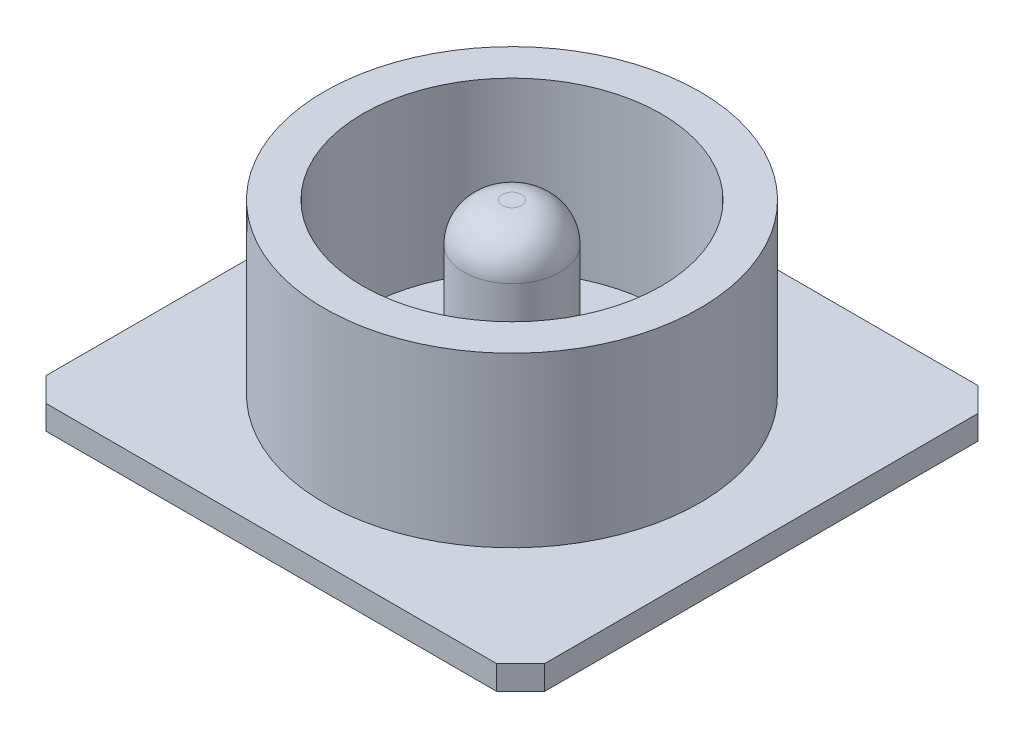
ISO-10303-21;
HEADER;
FILE_DESCRIPTION(('STEP AP214'),'2;1');
FILE_NAME('part.step','',(''),(''),'','','');
FILE_SCHEMA(('AUTOMOTIVE_DESIGN { 1 0 10303 214 1 1 1 1 }'));
ENDSEC;
DATA;
#1=APPLICATION_CONTEXT('core data for automotive mechanical design processes');
#2=APPLICATION_PROTOCOL_DEFINITION('international standard','automotive_design',2000,#1);
#3=PRODUCT_CONTEXT('',#1,'mechanical');
#4=PRODUCT('Part','Part','',(#3));
#5=PRODUCT_RELATED_PRODUCT_CATEGORY('part','',(#4));
#6=PRODUCT_DEFINITION_FORMATION('','',#4);
#7=PRODUCT_DEFINITION_CONTEXT('part definition',#1,'design');
#8=PRODUCT_DEFINITION('design','',#6,#7);
#9=PRODUCT_DEFINITION_SHAPE('','',#8);
#10=(LENGTH_UNIT() NAMED_UNIT(*) SI_UNIT(.MILLI.,.METRE.));
#11=(NAMED_UNIT(*) PLANE_ANGLE_UNIT() SI_UNIT($,.RADIAN.));
#12=(NAMED_UNIT(*) SI_UNIT($,.STERADIAN.) SOLID_ANGLE_UNIT());
#13=UNCERTAINTY_MEASURE_WITH_UNIT(LENGTH_MEASURE(1.E-05),#10,'distance_accuracy_value','');
#14=(GEOMETRIC_REPRESENTATION_CONTEXT(3) GLOBAL_UNCERTAINTY_ASSIGNED_CONTEXT((#13)) GLOBAL_UNIT_ASSIGNED_CONTEXT((#10,
#11,#12)) REPRESENTATION_CONTEXT('',''));
#15=CARTESIAN_POINT('',(0.,0.,0.));
#16=DIRECTION('',(0.,0.,1.));
#17=DIRECTION('',(1.,0.,0.));
#18=AXIS2_PLACEMENT_3D('',#15,#16,#17);
#19=CARTESIAN_POINT('',(-2.98595206377024,0.889,0.));
#20=DIRECTION('',(0.,1.,0.));
#21=DIRECTION('',(0.,0.,1.));
#22=AXIS2_PLACEMENT_3D('',#19,#20,#21);
#23=PLANE('',#22);
#24=CARTESIAN_POINT('',(0.,0.889,0.));
#25=DIRECTION('',(0.,-1.,0.));
#26=DIRECTION('',(0.,0.,-1.));
#27=AXIS2_PLACEMENT_3D('',#24,#25,#26);
#28=CIRCLE('',#27,0.0507999999999999);
#29=CARTESIAN_POINT('',(0.,0.889,-0.0507999999999996));
#30=VERTEX_POINT('',#29);
#31=CARTESIAN_POINT('',(0.,0.889,0.0508000000000001));
#32=VERTEX_POINT('',#31);
#33=EDGE_CURVE('E89',#30,#32,#28,.T.);
#34=ORIENTED_EDGE('',*,*,#33,.F.);
#35=CARTESIAN_POINT('',(0.,0.889,0.));
#36=DIRECTION('',(0.,-1.,0.));
#37=DIRECTION('',(0.,0.,1.));
#38=AXIS2_PLACEMENT_3D('',#35,#36,#37);
#39=CIRCLE('',#38,0.0507999999999999);
#40=EDGE_CURVE('E87',#32,#30,#39,.T.);
#41=ORIENTED_EDGE('',*,*,#40,.F.);
#42=EDGE_LOOP('',(#34,#41));
#43=FACE_BOUND('',#42,.T.);
#44=ADVANCED_FACE('F17',(#43),#23,.T.);
#45=CARTESIAN_POINT('',(0.,0.6858,0.0508000000000001));
#46=DIRECTION('',(1.,0.,0.));
#47=DIRECTION('',(0.,0.,1.));
#48=AXIS2_PLACEMENT_3D('',#45,#46,#47);
#49=CIRCLE('',#48,0.2032);
#50=TRIMMED_CURVE('',#49,(PARAMETER_VALUE(-1.82347658193697)),
(PARAMETER_VALUE(1.82347658193697)),.T.,.PARAMETER.);
#51=CARTESIAN_POINT('',(0.,0.6858,0.));
#52=DIRECTION('',(0.,1.,0.));
#53=AXIS1_PLACEMENT('',#51,#52);
#54=SURFACE_OF_REVOLUTION('',#50,#53);
#55=ORIENTED_EDGE('',*,*,#40,.T.);
#56=ORIENTED_EDGE('',*,*,#33,.T.);
#57=EDGE_LOOP('',(#55,#56));
#58=FACE_BOUND('',#57,.T.);
#59=CARTESIAN_POINT('',(0.,0.6858,0.));
#60=DIRECTION('',(0.,-1.,0.));
#61=DIRECTION('',(0.,0.,-1.));
#62=AXIS2_PLACEMENT_3D('',#59,#60,#61);
#63=CIRCLE('',#62,0.254);
#64=CARTESIAN_POINT('',(0.,0.6858,-0.254));
#65=VERTEX_POINT('',#64);
#66=EDGE_CURVE('E95',#65,#65,#63,.T.);
#67=ORIENTED_EDGE('',*,*,#66,.F.);
#68=EDGE_LOOP('',(#67));
#69=FACE_BOUND('',#68,.T.);
#70=ADVANCED_FACE('F91',(#58,#69),#54,.F.);
#71=CARTESIAN_POINT('',(0.,0.889,0.));
#72=DIRECTION('',(0.,-1.,0.));
#73=DIRECTION('',(0.,0.,-1.));
#74=AXIS2_PLACEMENT_3D('',#71,#72,#73);
#75=CYLINDRICAL_SURFACE('',#74,0.254);
#76=CARTESIAN_POINT('',(0.,0.,0.));
#77=DIRECTION('',(0.,-1.,0.));
#78=DIRECTION('',(0.,0.,-1.));
#79=AXIS2_PLACEMENT_3D('',#76,#77,#78);
#80=CIRCLE('',#79,0.254);
#81=CARTESIAN_POINT('',(0.,0.,-0.254));
#82=VERTEX_POINT('',#81);
#83=EDGE_CURVE('E145',#82,#82,#80,.T.);
#84=ORIENTED_EDGE('',*,*,#83,.F.);
#85=EDGE_LOOP('',(#84));
#86=FACE_BOUND('',#85,.T.);
#87=ORIENTED_EDGE('',*,*,#66,.T.);
#88=EDGE_LOOP('',(#87));
#89=FACE_BOUND('',#88,.T.);
#90=ADVANCED_FACE('F121',(#86,#89),#75,.T.);
#91=CARTESIAN_POINT('',(-2.98595206377024,0.,0.));
#92=DIRECTION('',(0.,1.,0.));
#93=DIRECTION('',(0.,0.,1.));
#94=AXIS2_PLACEMENT_3D('',#91,#92,#93);
#95=PLANE('',#94);
#96=ORIENTED_EDGE('',*,*,#83,.T.);
#97=EDGE_LOOP('',(#96));
#98=FACE_BOUND('',#97,.T.);
#99=CARTESIAN_POINT('',(0.,0.,0.));
#100=DIRECTION('',(0.,-1.,0.));
#101=DIRECTION('',(0.,0.,-1.));
#102=AXIS2_PLACEMENT_3D('',#99,#100,#101);
#103=CIRCLE('',#102,0.7874);
#104=CARTESIAN_POINT('',(0.,0.,-0.7874));
#105=VERTEX_POINT('',#104);
#106=EDGE_CURVE('E142',#105,#105,#103,.F.);
#107=ORIENTED_EDGE('',*,*,#106,.T.);
#108=EDGE_LOOP('',(#107));
#109=FACE_BOUND('',#108,.T.);
#110=ADVANCED_FACE('F153',(#98,#109),#95,.T.);
#111=CARTESIAN_POINT('',(0.,0.889,0.));
#112=DIRECTION('',(0.,-1.,0.));
#113=DIRECTION('',(0.,0.,-1.));
#114=AXIS2_PLACEMENT_3D('',#111,#112,#113);
#115=CYLINDRICAL_SURFACE('',#114,0.7874);
#116=CARTESIAN_POINT('',(0.,0.889,0.));
#117=DIRECTION('',(0.,-1.,0.));
#118=DIRECTION('',(0.,0.,-1.));
#119=AXIS2_PLACEMENT_3D('',#116,#117,#118);
#120=CIRCLE('',#119,0.7874);
#121=CARTESIAN_POINT('',(0.,0.889,-0.7874));
#122=VERTEX_POINT('',#121);
#123=EDGE_CURVE('E139',#122,#122,#120,.T.);
#124=ORIENTED_EDGE('',*,*,#123,.F.);
#125=EDGE_LOOP('',(#124));
#126=FACE_BOUND('',#125,.T.);
#127=ORIENTED_EDGE('',*,*,#106,.F.);
#128=EDGE_LOOP('',(#127));
#129=FACE_BOUND('',#128,.T.);
#130=ADVANCED_FACE('F159',(#126,#129),#115,.F.);
#131=CARTESIAN_POINT('',(-2.98595206377024,0.889,0.));
#132=DIRECTION('',(0.,1.,0.));
#133=DIRECTION('',(0.,0.,1.));
#134=AXIS2_PLACEMENT_3D('',#131,#132,#133);
#135=PLANE('',#134);
#136=CARTESIAN_POINT('',(0.,0.889,0.));
#137=DIRECTION('',(0.,-1.,0.));
#138=DIRECTION('',(0.,0.,-1.));
#139=AXIS2_PLACEMENT_3D('',#136,#137,#138);
#140=CIRCLE('',#139,0.990599999999999);
#141=CARTESIAN_POINT('',(0.,0.889,-0.990599999999999));
#142=VERTEX_POINT('',#141);
#143=EDGE_CURVE('E136',#142,#142,#140,.T.);
#144=ORIENTED_EDGE('',*,*,#143,.F.);
#145=EDGE_LOOP('',(#144));
#146=FACE_BOUND('',#145,.T.);
#147=ORIENTED_EDGE('',*,*,#123,.T.);
#148=EDGE_LOOP('',(#147));
#149=FACE_BOUND('',#148,.T.);
#150=ADVANCED_FACE('F207',(#146,#149),#135,.T.);
#151=CARTESIAN_POINT('',(0.,0.889,0.));
#152=DIRECTION('',(0.,-1.,0.));
#153=DIRECTION('',(0.,0.,-1.));
#154=AXIS2_PLACEMENT_3D('',#151,#152,#153);
#155=CYLINDRICAL_SURFACE('',#154,0.990599999999999);
#156=CARTESIAN_POINT('',(0.,0.,0.));
#157=DIRECTION('',(0.,-1.,0.));
#158=DIRECTION('',(0.,0.,-1.));
#159=AXIS2_PLACEMENT_3D('',#156,#157,#158);
#160=CIRCLE('',#159,0.990599999999999);
#161=CARTESIAN_POINT('',(0.,0.,-0.990599999999999));
#162=VERTEX_POINT('',#161);
#163=EDGE_CURVE('E127',#162,#162,#160,.T.);
#164=ORIENTED_EDGE('',*,*,#163,.F.);
#165=EDGE_LOOP('',(#164));
#166=FACE_BOUND('',#165,.T.);
#167=ORIENTED_EDGE('',*,*,#143,.T.);
#168=EDGE_LOOP('',(#167));
#169=FACE_BOUND('',#168,.T.);
#170=ADVANCED_FACE('F203',(#166,#169),#155,.T.);
#171=CARTESIAN_POINT('',(-2.98595206377024,0.,0.));
#172=DIRECTION('',(0.,1.,0.));
#173=DIRECTION('',(0.,0.,1.));
#174=AXIS2_PLACEMENT_3D('',#171,#172,#173);
#175=PLANE('',#174);
#176=ORIENTED_EDGE('',*,*,#163,.T.);
#177=EDGE_LOOP('',(#176));
#178=FACE_BOUND('',#177,.T.);
#179=DIRECTION('',(0.,0.,-1.));
#180=VECTOR('',#179,1.);
#181=CARTESIAN_POINT('',(1.31553605108081,0.,0.));
#182=LINE('',#181,#180);
#183=CARTESIAN_POINT('',(1.31553605108081,0.,-1.143));
#184=VERTEX_POINT('',#183);
#185=CARTESIAN_POINT('',(1.31553605108081,0.,1.143));
#186=VERTEX_POINT('',#185);
#187=EDGE_CURVE('E332',#184,#186,#182,.F.);
#188=ORIENTED_EDGE('',*,*,#187,.F.);
#189=DIRECTION('',(-0.707106781186548,0.,-0.707106781186548));
#190=VECTOR('',#189,1.);
#191=CARTESIAN_POINT('',(1.31553605108081,0.,-1.143));
#192=LINE('',#191,#190);
#193=CARTESIAN_POINT('',(1.18853605108081,0.,-1.27));
#194=VERTEX_POINT('',#193);
#195=EDGE_CURVE('E334',#194,#184,#192,.F.);
#196=ORIENTED_EDGE('',*,*,#195,.F.);
#197=DIRECTION('',(1.,0.,0.));
#198=VECTOR('',#197,1.);
#199=CARTESIAN_POINT('',(-2.98595206377024,0.,-1.27));
#200=LINE('',#199,#198);
#201=CARTESIAN_POINT('',(-1.18853605108081,0.,-1.27));
#202=VERTEX_POINT('',#201);
#203=EDGE_CURVE('E350',#194,#202,#200,.F.);
#204=ORIENTED_EDGE('',*,*,#203,.T.);
#205=DIRECTION('',(0.707106781186545,0.,-0.70710678118655));
#206=VECTOR('',#205,1.);
#207=CARTESIAN_POINT('',(-1.18853605108081,0.,-1.27));
#208=LINE('',#207,#206);
#209=CARTESIAN_POINT('',(-1.31553605108081,0.,-1.143));
#210=VERTEX_POINT('',#209);
#211=EDGE_CURVE('E371',#202,#210,#208,.F.);
#212=ORIENTED_EDGE('',*,*,#211,.T.);
#213=DIRECTION('',(0.,0.,-1.));
#214=VECTOR('',#213,1.);
#215=CARTESIAN_POINT('',(-1.31553605108081,0.,0.));
#216=LINE('',#215,#214);
#217=CARTESIAN_POINT('',(-1.31553605108081,0.,1.143));
#218=VERTEX_POINT('',#217);
#219=EDGE_CURVE('E370',#210,#218,#216,.F.);
#220=ORIENTED_EDGE('',*,*,#219,.T.);
#221=DIRECTION('',(0.707106781186549,0.,0.707106781186546));
#222=VECTOR('',#221,1.);
#223=CARTESIAN_POINT('',(-1.31553605108081,0.,1.143));
#224=LINE('',#223,#222);
#225=CARTESIAN_POINT('',(-1.18853605108081,0.,1.27));
#226=VERTEX_POINT('',#225);
#227=EDGE_CURVE('E135',#226,#218,#224,.F.);
#228=ORIENTED_EDGE('',*,*,#227,.F.);
#229=DIRECTION('',(1.,0.,0.));
#230=VECTOR('',#229,1.);
#231=CARTESIAN_POINT('',(-2.98595206377024,0.,1.27));
#232=LINE('',#231,#230);
#233=CARTESIAN_POINT('',(1.18853605108081,0.,1.27));
#234=VERTEX_POINT('',#233);
#235=EDGE_CURVE('E362',#234,#226,#232,.F.);
#236=ORIENTED_EDGE('',*,*,#235,.F.);
#237=DIRECTION('',(-0.707106781186545,0.,0.70710678118655));
#238=VECTOR('',#237,1.);
#239=CARTESIAN_POINT('',(1.18853605108081,0.,1.27));
#240=LINE('',#239,#238);
#241=EDGE_CURVE('E337',#234,#186,#240,.F.);
#242=ORIENTED_EDGE('',*,*,#241,.T.);
#243=EDGE_LOOP('',(#188,#196,#204,#212,#220,#228,#236,#242));
#244=FACE_BOUND('',#243,.T.);
#245=ADVANCED_FACE('F199',(#178,#244),#175,.T.);
#246=CARTESIAN_POINT('',(-1.31553605108081,-0.127,1.143));
#247=DIRECTION('',(-0.707106781186546,0.,0.707106781186549));
#248=DIRECTION('',(0.707106781186549,0.,0.707106781186546));
#249=AXIS2_PLACEMENT_3D('',#246,#247,#248);
#250=PLANE('',#249);
#251=ORIENTED_EDGE('',*,*,#227,.T.);
#252=DIRECTION('',(0.,1.,0.));
#253=VECTOR('',#252,1.);
#254=CARTESIAN_POINT('',(-1.31553605108081,-0.127,1.143));
#255=LINE('',#254,#253);
#256=CARTESIAN_POINT('',(-1.31553605108081,-0.127,1.143));
#257=VERTEX_POINT('',#256);
#258=EDGE_CURVE('E368',#218,#257,#255,.F.);
#259=ORIENTED_EDGE('',*,*,#258,.T.);
#260=DIRECTION('',(0.707106781186547,0.,0.707106781186547));
#261=VECTOR('',#260,1.);
#262=CARTESIAN_POINT('',(-1.31553605108081,-0.127,1.143));
#263=LINE('',#262,#261);
#264=CARTESIAN_POINT('',(-1.18853605108081,-0.127,1.27));
#265=VERTEX_POINT('',#264);
#266=EDGE_CURVE('E374',#257,#265,#263,.T.);
#267=ORIENTED_EDGE('',*,*,#266,.T.);
#268=DIRECTION('',(0.,1.,0.));
#269=VECTOR('',#268,1.);
#270=CARTESIAN_POINT('',(-1.18853605108081,-0.127,1.27));
#271=LINE('',#270,#269);
#272=EDGE_CURVE('E360',#226,#265,#271,.F.);
#273=ORIENTED_EDGE('',*,*,#272,.F.);
#274=EDGE_LOOP('',(#251,#259,#267,#273));
#275=FACE_BOUND('',#274,.T.);
#276=ADVANCED_FACE('F195',(#275),#250,.T.);
#277=CARTESIAN_POINT('',(-2.98595206377024,-0.127,1.27));
#278=DIRECTION('',(0.,0.,1.));
#279=DIRECTION('',(1.,0.,0.));
#280=AXIS2_PLACEMENT_3D('',#277,#278,#279);
#281=PLANE('',#280);
#282=ORIENTED_EDGE('',*,*,#235,.T.);
#283=ORIENTED_EDGE('',*,*,#272,.T.);
#284=DIRECTION('',(1.,0.,0.));
#285=VECTOR('',#284,1.);
#286=CARTESIAN_POINT('',(-2.98595206377024,-0.127,1.27));
#287=LINE('',#286,#285);
#288=CARTESIAN_POINT('',(1.18853605108081,-0.127,1.27));
#289=VERTEX_POINT('',#288);
#290=EDGE_CURVE('E376',#265,#289,#287,.T.);
#291=ORIENTED_EDGE('',*,*,#290,.T.);
#292=DIRECTION('',(0.,1.,0.));
#293=VECTOR('',#292,1.);
#294=CARTESIAN_POINT('',(1.18853605108081,-0.127,1.27));
#295=LINE('',#294,#293);
#296=EDGE_CURVE('E357',#289,#234,#295,.T.);
#297=ORIENTED_EDGE('',*,*,#296,.T.);
#298=EDGE_LOOP('',(#282,#283,#291,#297));
#299=FACE_BOUND('',#298,.T.);
#300=ADVANCED_FACE('F191',(#299),#281,.T.);
#301=CARTESIAN_POINT('',(1.18853605108081,-0.127,1.27));
#302=DIRECTION('',(-0.70710678118655,0.,-0.707106781186545));
#303=DIRECTION('',(-0.707106781186545,0.,0.70710678118655));
#304=AXIS2_PLACEMENT_3D('',#301,#302,#303);
#305=PLANE('',#304);
#306=DIRECTION('',(0.,1.,0.));
#307=VECTOR('',#306,1.);
#308=CARTESIAN_POINT('',(1.31553605108081,-0.127,1.143));
#309=LINE('',#308,#307);
#310=CARTESIAN_POINT('',(1.31553605108081,-0.127,1.143));
#311=VERTEX_POINT('',#310);
#312=EDGE_CURVE('E339',#186,#311,#309,.F.);
#313=ORIENTED_EDGE('',*,*,#312,.F.);
#314=ORIENTED_EDGE('',*,*,#241,.F.);
#315=ORIENTED_EDGE('',*,*,#296,.F.);
#316=DIRECTION('',(0.707106781186544,0.,-0.707106781186551));
#317=VECTOR('',#316,1.);
#318=CARTESIAN_POINT('',(1.18853605108081,-0.127,1.27));
#319=LINE('',#318,#317);
#320=EDGE_CURVE('E394',#289,#311,#319,.T.);
#321=ORIENTED_EDGE('',*,*,#320,.T.);
#322=EDGE_LOOP('',(#313,#314,#315,#321));
#323=FACE_BOUND('',#322,.T.);
#324=ADVANCED_FACE('F187',(#323),#305,.F.);
#325=CARTESIAN_POINT('',(1.31553605108081,-0.127,0.));
#326=DIRECTION('',(1.,0.,0.));
#327=DIRECTION('',(0.,0.,-1.));
#328=AXIS2_PLACEMENT_3D('',#325,#326,#327);
#329=PLANE('',#328);
#330=ORIENTED_EDGE('',*,*,#187,.T.);
#331=ORIENTED_EDGE('',*,*,#312,.T.);
#332=DIRECTION('',(0.,0.,1.));
#333=VECTOR('',#332,1.);
#334=CARTESIAN_POINT('',(1.31553605108081,-0.127,0.));
#335=LINE('',#334,#333);
#336=CARTESIAN_POINT('',(1.31553605108081,-0.127,-1.143));
#337=VERTEX_POINT('',#336);
#338=EDGE_CURVE('E344',#311,#337,#335,.F.);
#339=ORIENTED_EDGE('',*,*,#338,.T.);
#340=DIRECTION('',(0.,1.,0.));
#341=VECTOR('',#340,1.);
#342=CARTESIAN_POINT('',(1.31553605108081,-0.127,-1.143));
#343=LINE('',#342,#341);
#344=EDGE_CURVE('E342',#184,#337,#343,.F.);
#345=ORIENTED_EDGE('',*,*,#344,.F.);
#346=EDGE_LOOP('',(#330,#331,#339,#345));
#347=FACE_BOUND('',#346,.T.);
#348=ADVANCED_FACE('F183',(#347),#329,.T.);
#349=CARTESIAN_POINT('',(1.31553605108081,-0.127,-1.143));
#350=DIRECTION('',(0.707106781186548,0.,-0.707106781186548));
#351=DIRECTION('',(-0.707106781186548,0.,-0.707106781186548));
#352=AXIS2_PLACEMENT_3D('',#349,#350,#351);
#353=PLANE('',#352);
#354=ORIENTED_EDGE('',*,*,#195,.T.);
#355=ORIENTED_EDGE('',*,*,#344,.T.);
#356=DIRECTION('',(-0.707106781186551,0.,-0.707106781186545));
#357=VECTOR('',#356,1.);
#358=CARTESIAN_POINT('',(1.31553605108081,-0.127,-1.143));
#359=LINE('',#358,#357);
#360=CARTESIAN_POINT('',(1.18853605108081,-0.127,-1.27));
#361=VERTEX_POINT('',#360);
#362=EDGE_CURVE('E388',#337,#361,#359,.T.);
#363=ORIENTED_EDGE('',*,*,#362,.T.);
#364=DIRECTION('',(0.,1.,0.));
#365=VECTOR('',#364,1.);
#366=CARTESIAN_POINT('',(1.18853605108081,-0.127,-1.27));
#367=LINE('',#366,#365);
#368=EDGE_CURVE('E347',#361,#194,#367,.T.);
#369=ORIENTED_EDGE('',*,*,#368,.T.);
#370=EDGE_LOOP('',(#354,#355,#363,#369));
#371=FACE_BOUND('',#370,.T.);
#372=ADVANCED_FACE('F179',(#371),#353,.T.);
#373=CARTESIAN_POINT('',(-2.98595206377024,-0.127,-1.27));
#374=DIRECTION('',(0.,0.,1.));
#375=DIRECTION('',(1.,0.,0.));
#376=AXIS2_PLACEMENT_3D('',#373,#374,#375);
#377=PLANE('',#376);
#378=DIRECTION('',(0.,1.,0.));
#379=VECTOR('',#378,1.);
#380=CARTESIAN_POINT('',(-1.18853605108081,-0.127,-1.27));
#381=LINE('',#380,#379);
#382=CARTESIAN_POINT('',(-1.18853605108081,-0.127,-1.27));
#383=VERTEX_POINT('',#382);
#384=EDGE_CURVE('E382',#383,#202,#381,.T.);
#385=ORIENTED_EDGE('',*,*,#384,.T.);
#386=ORIENTED_EDGE('',*,*,#203,.F.);
#387=ORIENTED_EDGE('',*,*,#368,.F.);
#388=DIRECTION('',(1.,0.,0.));
#389=VECTOR('',#388,1.);
#390=CARTESIAN_POINT('',(-2.98595206377024,-0.127,-1.27));
#391=LINE('',#390,#389);
#392=EDGE_CURVE('E387',#361,#383,#391,.F.);
#393=ORIENTED_EDGE('',*,*,#392,.T.);
#394=EDGE_LOOP('',(#385,#386,#387,#393));
#395=FACE_BOUND('',#394,.T.);
#396=ADVANCED_FACE('F175',(#395),#377,.F.);
#397=CARTESIAN_POINT('',(-1.18853605108081,-0.127,-1.27));
#398=DIRECTION('',(0.70710678118655,0.,0.707106781186545));
#399=DIRECTION('',(0.707106781186545,0.,-0.70710678118655));
#400=AXIS2_PLACEMENT_3D('',#397,#398,#399);
#401=PLANE('',#400);
#402=DIRECTION('',(0.,1.,0.));
#403=VECTOR('',#402,1.);
#404=CARTESIAN_POINT('',(-1.31553605108081,-0.127,-1.143));
#405=LINE('',#404,#403);
#406=CARTESIAN_POINT('',(-1.31553605108081,-0.127,-1.143));
#407=VERTEX_POINT('',#406);
#408=EDGE_CURVE('E36',#407,#210,#405,.T.);
#409=ORIENTED_EDGE('',*,*,#408,.T.);
#410=ORIENTED_EDGE('',*,*,#211,.F.);
#411=ORIENTED_EDGE('',*,*,#384,.F.);
#412=DIRECTION('',(-0.707106781186545,0.,0.707106781186551));
#413=VECTOR('',#412,1.);
#414=CARTESIAN_POINT('',(-1.18853605108081,-0.127,-1.27));
#415=LINE('',#414,#413);
#416=EDGE_CURVE('E28',#383,#407,#415,.T.);
#417=ORIENTED_EDGE('',*,*,#416,.T.);
#418=EDGE_LOOP('',(#409,#410,#411,#417));
#419=FACE_BOUND('',#418,.T.);
#420=ADVANCED_FACE('F169',(#419),#401,.F.);
#421=CARTESIAN_POINT('',(-1.31553605108081,-0.127,0.));
#422=DIRECTION('',(1.,0.,0.));
#423=DIRECTION('',(0.,0.,-1.));
#424=AXIS2_PLACEMENT_3D('',#421,#422,#423);
#425=PLANE('',#424);
#426=ORIENTED_EDGE('',*,*,#408,.F.);
#427=DIRECTION('',(0.,0.,1.));
#428=VECTOR('',#427,1.);
#429=CARTESIAN_POINT('',(-1.31553605108081,-0.127,0.));
#430=LINE('',#429,#428);
#431=EDGE_CURVE('E11',#407,#257,#430,.T.);
#432=ORIENTED_EDGE('',*,*,#431,.T.);
#433=ORIENTED_EDGE('',*,*,#258,.F.);
#434=ORIENTED_EDGE('',*,*,#219,.F.);
#435=EDGE_LOOP('',(#426,#432,#433,#434));
#436=FACE_BOUND('',#435,.T.);
#437=ADVANCED_FACE('F162',(#436),#425,.F.);
#438=CARTESIAN_POINT('',(-2.98595206377024,-0.127,0.));
#439=DIRECTION('',(0.,1.,0.));
#440=DIRECTION('',(0.,0.,1.));
#441=AXIS2_PLACEMENT_3D('',#438,#439,#440);
#442=PLANE('',#441);
#443=ORIENTED_EDGE('',*,*,#416,.F.);
#444=ORIENTED_EDGE('',*,*,#392,.F.);
#445=ORIENTED_EDGE('',*,*,#362,.F.);
#446=ORIENTED_EDGE('',*,*,#338,.F.);
#447=ORIENTED_EDGE('',*,*,#320,.F.);
#448=ORIENTED_EDGE('',*,*,#290,.F.);
#449=ORIENTED_EDGE('',*,*,#266,.F.);
#450=ORIENTED_EDGE('',*,*,#431,.F.);
#451=EDGE_LOOP('',(#443,#444,#445,#446,#447,#448,#449,#450));
#452=FACE_BOUND('',#451,.T.);
#453=ADVANCED_FACE('F160',(#452),#442,.F.);
#454=CLOSED_SHELL('',(#44,#70,#90,#110,#130,#150,#170,#245,#276,#300,#324,#348,#372,#396,#420,
#437,#453));
#455=MANIFOLD_SOLID_BREP('B1',#454);
#456=ADVANCED_BREP_SHAPE_REPRESENTATION('',(#18,#455),#14);
#457=SHAPE_DEFINITION_REPRESENTATION(#9,#456);
ENDSEC;
END-ISO-10303-21;
